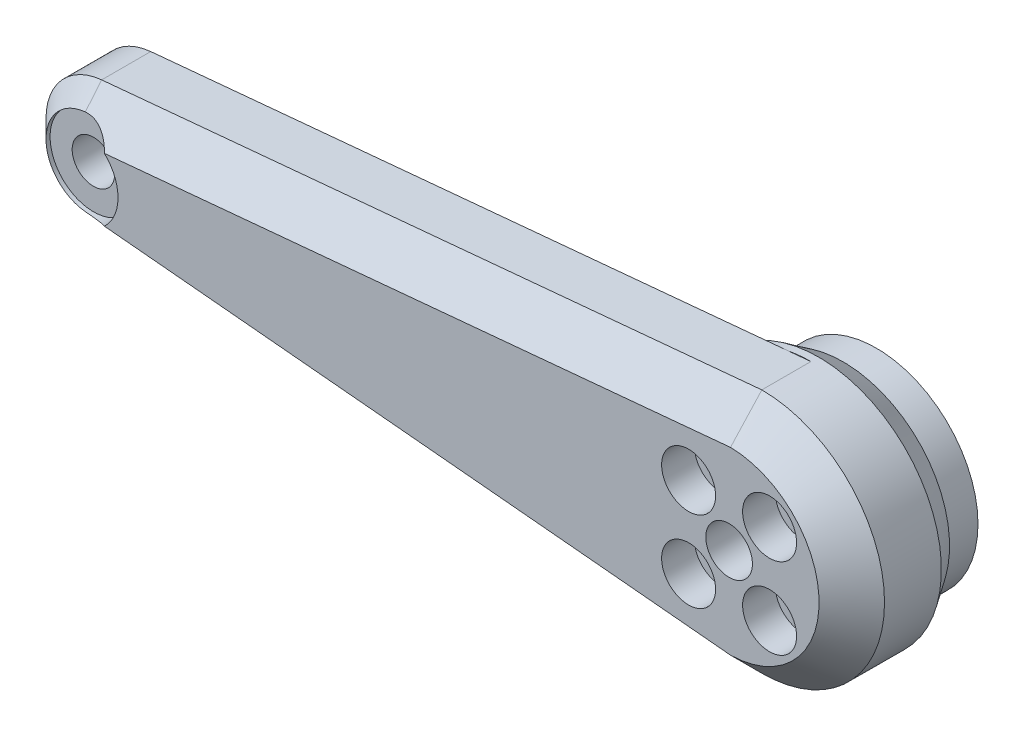
ISO-10303-21;
HEADER;
FILE_DESCRIPTION(('STEP AP214'),'2;1');
FILE_NAME('part.step','',(''),(''),'','','');
FILE_SCHEMA(('AUTOMOTIVE_DESIGN { 1 0 10303 214 1 1 1 1 }'));
ENDSEC;
DATA;
#1=APPLICATION_CONTEXT('core data for automotive mechanical design processes');
#2=APPLICATION_PROTOCOL_DEFINITION('international standard','automotive_design',2000,#1);
#3=PRODUCT_CONTEXT('',#1,'mechanical');
#4=PRODUCT('Part','Part','',(#3));
#5=PRODUCT_RELATED_PRODUCT_CATEGORY('part','',(#4));
#6=PRODUCT_DEFINITION_FORMATION('','',#4);
#7=PRODUCT_DEFINITION_CONTEXT('part definition',#1,'design');
#8=PRODUCT_DEFINITION('design','',#6,#7);
#9=PRODUCT_DEFINITION_SHAPE('','',#8);
#10=(LENGTH_UNIT() NAMED_UNIT(*) SI_UNIT(.MILLI.,.METRE.));
#11=(NAMED_UNIT(*) PLANE_ANGLE_UNIT() SI_UNIT($,.RADIAN.));
#12=(NAMED_UNIT(*) SI_UNIT($,.STERADIAN.) SOLID_ANGLE_UNIT());
#13=UNCERTAINTY_MEASURE_WITH_UNIT(LENGTH_MEASURE(1.E-05),#10,'distance_accuracy_value','');
#14=(GEOMETRIC_REPRESENTATION_CONTEXT(3) GLOBAL_UNCERTAINTY_ASSIGNED_CONTEXT((#13)) GLOBAL_UNIT_ASSIGNED_CONTEXT((#10,
#11,#12)) REPRESENTATION_CONTEXT('',''));
#15=CARTESIAN_POINT('',(0.,0.,0.));
#16=DIRECTION('',(0.,0.,1.));
#17=DIRECTION('',(1.,0.,0.));
#18=AXIS2_PLACEMENT_3D('',#15,#16,#17);
#19=CARTESIAN_POINT('',(-4.94974746830583,4.94974746830583,10.));
#20=DIRECTION('',(0.,0.,-1.));
#21=DIRECTION('',(-1.,0.,0.));
#22=AXIS2_PLACEMENT_3D('',#19,#20,#21);
#23=CYLINDRICAL_SURFACE('',#22,1.75);
#24=CARTESIAN_POINT('',(-4.94974746830583,4.94974746830583,-8.));
#25=DIRECTION('',(0.,0.,-1.));
#26=DIRECTION('',(-1.,0.,0.));
#27=AXIS2_PLACEMENT_3D('',#24,#25,#26);
#28=CIRCLE('',#27,1.75);
#29=CARTESIAN_POINT('',(-6.69974746830583,4.94974746830583,-8.));
#30=VERTEX_POINT('',#29);
#31=EDGE_CURVE('E371',#30,#30,#28,.T.);
#32=ORIENTED_EDGE('',*,*,#31,.T.);
#33=EDGE_LOOP('',(#32));
#34=FACE_BOUND('',#33,.T.);
#35=CARTESIAN_POINT('',(-4.94974746830583,4.94974746830583,6.));
#36=DIRECTION('',(0.,0.,1.));
#37=DIRECTION('',(1.,0.,0.));
#38=AXIS2_PLACEMENT_3D('',#35,#36,#37);
#39=CIRCLE('',#38,1.75);
#40=CARTESIAN_POINT('',(-3.19974746830583,4.94974746830583,6.));
#41=VERTEX_POINT('',#40);
#42=EDGE_CURVE('E48',#41,#41,#39,.F.);
#43=ORIENTED_EDGE('',*,*,#42,.F.);
#44=EDGE_LOOP('',(#43));
#45=FACE_BOUND('',#44,.T.);
#46=ADVANCED_FACE('F43',(#34,#45),#23,.F.);
#47=CARTESIAN_POINT('',(4.94974746830581,4.94974746830584,10.));
#48=DIRECTION('',(0.,0.,-1.));
#49=DIRECTION('',(-1.,0.,0.));
#50=AXIS2_PLACEMENT_3D('',#47,#48,#49);
#51=CYLINDRICAL_SURFACE('',#50,1.75);
#52=CARTESIAN_POINT('',(4.94974746830581,4.94974746830584,-8.));
#53=DIRECTION('',(0.,0.,-1.));
#54=DIRECTION('',(-1.,0.,0.));
#55=AXIS2_PLACEMENT_3D('',#52,#53,#54);
#56=CIRCLE('',#55,1.75);
#57=CARTESIAN_POINT('',(3.19974746830581,4.94974746830584,-8.));
#58=VERTEX_POINT('',#57);
#59=EDGE_CURVE('E367',#58,#58,#56,.T.);
#60=ORIENTED_EDGE('',*,*,#59,.T.);
#61=EDGE_LOOP('',(#60));
#62=FACE_BOUND('',#61,.T.);
#63=CARTESIAN_POINT('',(4.94974746830581,4.94974746830584,6.));
#64=DIRECTION('',(0.,0.,1.));
#65=DIRECTION('',(1.,0.,0.));
#66=AXIS2_PLACEMENT_3D('',#63,#64,#65);
#67=CIRCLE('',#66,1.75);
#68=CARTESIAN_POINT('',(6.69974746830581,4.94974746830584,6.));
#69=VERTEX_POINT('',#68);
#70=EDGE_CURVE('E231',#69,#69,#67,.F.);
#71=ORIENTED_EDGE('',*,*,#70,.F.);
#72=EDGE_LOOP('',(#71));
#73=FACE_BOUND('',#72,.T.);
#74=ADVANCED_FACE('F243',(#62,#73),#51,.F.);
#75=CARTESIAN_POINT('',(4.94974746830583,-4.94974746830584,10.));
#76=DIRECTION('',(0.,0.,-1.));
#77=DIRECTION('',(-1.,0.,0.));
#78=AXIS2_PLACEMENT_3D('',#75,#76,#77);
#79=CYLINDRICAL_SURFACE('',#78,1.75);
#80=CARTESIAN_POINT('',(4.94974746830583,-4.94974746830584,-8.));
#81=DIRECTION('',(0.,0.,-1.));
#82=DIRECTION('',(-1.,0.,0.));
#83=AXIS2_PLACEMENT_3D('',#80,#81,#82);
#84=CIRCLE('',#83,1.75);
#85=CARTESIAN_POINT('',(3.19974746830583,-4.94974746830584,-8.));
#86=VERTEX_POINT('',#85);
#87=EDGE_CURVE('E372',#86,#86,#84,.T.);
#88=ORIENTED_EDGE('',*,*,#87,.T.);
#89=EDGE_LOOP('',(#88));
#90=FACE_BOUND('',#89,.T.);
#91=CARTESIAN_POINT('',(4.94974746830583,-4.94974746830584,6.));
#92=DIRECTION('',(0.,0.,1.));
#93=DIRECTION('',(1.,0.,0.));
#94=AXIS2_PLACEMENT_3D('',#91,#92,#93);
#95=CIRCLE('',#94,1.75);
#96=CARTESIAN_POINT('',(6.69974746830583,-4.94974746830584,6.));
#97=VERTEX_POINT('',#96);
#98=EDGE_CURVE('E227',#97,#97,#95,.F.);
#99=ORIENTED_EDGE('',*,*,#98,.F.);
#100=EDGE_LOOP('',(#99));
#101=FACE_BOUND('',#100,.T.);
#102=ADVANCED_FACE('F249',(#90,#101),#79,.F.);
#103=CARTESIAN_POINT('',(-4.94974746830582,-4.94974746830585,10.));
#104=DIRECTION('',(0.,0.,-1.));
#105=DIRECTION('',(-1.,0.,0.));
#106=AXIS2_PLACEMENT_3D('',#103,#104,#105);
#107=CYLINDRICAL_SURFACE('',#106,1.75);
#108=CARTESIAN_POINT('',(-4.94974746830582,-4.94974746830585,-8.));
#109=DIRECTION('',(0.,0.,-1.));
#110=DIRECTION('',(-1.,0.,0.));
#111=AXIS2_PLACEMENT_3D('',#108,#109,#110);
#112=CIRCLE('',#111,1.75);
#113=CARTESIAN_POINT('',(-6.69974746830582,-4.94974746830585,-8.));
#114=VERTEX_POINT('',#113);
#115=EDGE_CURVE('E363',#114,#114,#112,.T.);
#116=ORIENTED_EDGE('',*,*,#115,.T.);
#117=EDGE_LOOP('',(#116));
#118=FACE_BOUND('',#117,.T.);
#119=CARTESIAN_POINT('',(-4.94974746830582,-4.94974746830585,6.));
#120=DIRECTION('',(0.,0.,1.));
#121=DIRECTION('',(1.,0.,0.));
#122=AXIS2_PLACEMENT_3D('',#119,#120,#121);
#123=CIRCLE('',#122,1.75);
#124=CARTESIAN_POINT('',(-3.19974746830582,-4.94974746830585,6.));
#125=VERTEX_POINT('',#124);
#126=EDGE_CURVE('E223',#125,#125,#123,.F.);
#127=ORIENTED_EDGE('',*,*,#126,.F.);
#128=EDGE_LOOP('',(#127));
#129=FACE_BOUND('',#128,.T.);
#130=ADVANCED_FACE('F255',(#118,#129),#107,.F.);
#131=CARTESIAN_POINT('',(-80.,0.,-8.));
#132=DIRECTION('',(0.,0.,1.));
#133=DIRECTION('',(1.,0.,0.));
#134=AXIS2_PLACEMENT_3D('',#131,#132,#133);
#135=CYLINDRICAL_SURFACE('',#134,2.6);
#136=CARTESIAN_POINT('',(-80.,0.,2.3));
#137=DIRECTION('',(0.,0.,-1.));
#138=DIRECTION('',(-1.,0.,0.));
#139=AXIS2_PLACEMENT_3D('',#136,#137,#138);
#140=CIRCLE('',#139,2.6);
#141=CARTESIAN_POINT('',(-82.6,0.,2.3));
#142=VERTEX_POINT('',#141);
#143=EDGE_CURVE('E208',#142,#142,#140,.F.);
#144=ORIENTED_EDGE('',*,*,#143,.F.);
#145=EDGE_LOOP('',(#144));
#146=FACE_BOUND('',#145,.T.);
#147=CARTESIAN_POINT('',(-80.,0.,7.7));
#148=DIRECTION('',(0.,0.,1.));
#149=DIRECTION('',(1.,0.,0.));
#150=AXIS2_PLACEMENT_3D('',#147,#148,#149);
#151=CIRCLE('',#150,2.6);
#152=CARTESIAN_POINT('',(-77.4,0.,7.7));
#153=VERTEX_POINT('',#152);
#154=EDGE_CURVE('E133',#153,#153,#151,.F.);
#155=ORIENTED_EDGE('',*,*,#154,.F.);
#156=EDGE_LOOP('',(#155));
#157=FACE_BOUND('',#156,.T.);
#158=ADVANCED_FACE('F273',(#146,#157),#135,.F.);
#159=CARTESIAN_POINT('',(0.,0.,0.));
#160=DIRECTION('',(0.,0.,1.));
#161=DIRECTION('',(1.,0.,0.));
#162=AXIS2_PLACEMENT_3D('',#159,#160,#161);
#163=PLANE('',#162);
#164=CARTESIAN_POINT('',(-80.,0.,0.));
#165=DIRECTION('',(0.,0.,-1.));
#166=DIRECTION('',(-1.,0.,0.));
#167=AXIS2_PLACEMENT_3D('',#164,#165,#166);
#168=CIRCLE('',#167,5.20000000000001);
#169=CARTESIAN_POINT('',(-85.2,0.,0.));
#170=VERTEX_POINT('',#169);
#171=EDGE_CURVE('E219',#170,#170,#168,.T.);
#172=ORIENTED_EDGE('',*,*,#171,.F.);
#173=EDGE_LOOP('',(#172));
#174=FACE_BOUND('',#173,.T.);
#175=CARTESIAN_POINT('',(0.,0.,0.));
#176=DIRECTION('',(0.,0.,-1.));
#177=DIRECTION('',(-1.,0.,0.));
#178=AXIS2_PLACEMENT_3D('',#175,#176,#177);
#179=CIRCLE('',#178,15.);
#180=CARTESIAN_POINT('',(-2.77608663815124,-14.7408732094635,0.));
#181=VERTEX_POINT('',#180);
#182=CARTESIAN_POINT('',(-2.77608663815124,14.7408732094635,0.));
#183=VERTEX_POINT('',#182);
#184=EDGE_CURVE('E302',#181,#183,#179,.T.);
#185=ORIENTED_EDGE('',*,*,#184,.F.);
#186=DIRECTION('',(0.995671853732669,-0.0929384725748753,0.));
#187=VECTOR('',#186,1.);
#188=CARTESIAN_POINT('',(-1.38804331907563,-14.8704366047317,0.));
#189=LINE('',#188,#187);
#190=CARTESIAN_POINT('',(-80.6970385443116,-7.46753890299503,0.));
#191=VERTEX_POINT('',#190);
#192=EDGE_CURVE('E296',#191,#181,#189,.T.);
#193=ORIENTED_EDGE('',*,*,#192,.F.);
#194=CARTESIAN_POINT('',(-80.,0.,0.));
#195=DIRECTION('',(0.,0.,1.));
#196=DIRECTION('',(1.,0.,0.));
#197=AXIS2_PLACEMENT_3D('',#194,#195,#196);
#198=CIRCLE('',#197,7.5);
#199=CARTESIAN_POINT('',(-80.6970385443116,7.46753890299501,0.));
#200=VERTEX_POINT('',#199);
#201=EDGE_CURVE('E207',#200,#191,#198,.T.);
#202=ORIENTED_EDGE('',*,*,#201,.F.);
#203=DIRECTION('',(0.995671853732669,0.0929384725748753,0.));
#204=VECTOR('',#203,1.);
#205=CARTESIAN_POINT('',(-1.38804331907563,14.8704366047317,0.));
#206=LINE('',#205,#204);
#207=EDGE_CURVE('E304',#200,#183,#206,.T.);
#208=ORIENTED_EDGE('',*,*,#207,.T.);
#209=EDGE_LOOP('',(#185,#193,#202,#208));
#210=FACE_BOUND('',#209,.T.);
#211=ADVANCED_FACE('F269',(#174,#210),#163,.F.);
#212=CARTESIAN_POINT('',(-80.,0.,10.));
#213=DIRECTION('',(0.,0.,-1.));
#214=DIRECTION('',(-1.,0.,0.));
#215=AXIS2_PLACEMENT_3D('',#212,#213,#214);
#216=CYLINDRICAL_SURFACE('',#215,7.5);
#217=DIRECTION('',(0.,0.,-1.));
#218=VECTOR('',#217,1.);
#219=CARTESIAN_POINT('',(-80.6970385443116,-7.46753890299503,10.));
#220=LINE('',#219,#218);
#221=CARTESIAN_POINT('',(-80.6970385443116,-7.46753890299503,6.));
#222=VERTEX_POINT('',#221);
#223=EDGE_CURVE('E140',#222,#191,#220,.T.);
#224=ORIENTED_EDGE('',*,*,#223,.F.);
#225=CARTESIAN_POINT('',(-80.,0.,6.));
#226=DIRECTION('',(0.,0.,1.));
#227=DIRECTION('',(1.,0.,0.));
#228=AXIS2_PLACEMENT_3D('',#225,#226,#227);
#229=CIRCLE('',#228,7.5);
#230=CARTESIAN_POINT('',(-80.6970385443116,7.46753890299501,6.));
#231=VERTEX_POINT('',#230);
#232=EDGE_CURVE('E156',#222,#231,#229,.F.);
#233=ORIENTED_EDGE('',*,*,#232,.T.);
#234=DIRECTION('',(0.,0.,-1.));
#235=VECTOR('',#234,1.);
#236=CARTESIAN_POINT('',(-80.6970385443116,7.46753890299501,10.));
#237=LINE('',#236,#235);
#238=EDGE_CURVE('E308',#231,#200,#237,.T.);
#239=ORIENTED_EDGE('',*,*,#238,.T.);
#240=ORIENTED_EDGE('',*,*,#201,.T.);
#241=EDGE_LOOP('',(#224,#233,#239,#240));
#242=FACE_BOUND('',#241,.T.);
#243=ADVANCED_FACE('F272',(#242),#216,.T.);
#244=CARTESIAN_POINT('',(-1.38804331907563,-14.8704366047317,10.));
#245=DIRECTION('',(0.0929384725748753,0.995671853732669,0.));
#246=DIRECTION('',(-0.995671853732669,0.0929384725748753,0.));
#247=AXIS2_PLACEMENT_3D('',#244,#245,#246);
#248=PLANE('',#247);
#249=DIRECTION('',(0.,0.,-1.));
#250=VECTOR('',#249,1.);
#251=CARTESIAN_POINT('',(0.,-15.,10.));
#252=LINE('',#251,#250);
#253=CARTESIAN_POINT('',(0.,-15.,6.));
#254=VERTEX_POINT('',#253);
#255=CARTESIAN_POINT('',(0.,-15.,0.));
#256=VERTEX_POINT('',#255);
#257=EDGE_CURVE('E146',#254,#256,#252,.T.);
#258=ORIENTED_EDGE('',*,*,#257,.F.);
#259=DIRECTION('',(-0.995671853732669,0.0929384725748753,0.));
#260=VECTOR('',#259,1.);
#261=CARTESIAN_POINT('',(-80.6970385443116,-7.46753890299503,6.));
#262=LINE('',#261,#260);
#263=EDGE_CURVE('E152',#254,#222,#262,.T.);
#264=ORIENTED_EDGE('',*,*,#263,.T.);
#265=ORIENTED_EDGE('',*,*,#223,.T.);
#266=ORIENTED_EDGE('',*,*,#192,.T.);
#267=DIRECTION('',(-0.995671853732669,0.0929384725748753,0.));
#268=VECTOR('',#267,1.);
#269=CARTESIAN_POINT('',(-1.38804331907563,-14.8704366047317,0.));
#270=LINE('',#269,#268);
#271=EDGE_CURVE('E323',#256,#181,#270,.T.);
#272=ORIENTED_EDGE('',*,*,#271,.F.);
#273=EDGE_LOOP('',(#258,#264,#265,#266,#272));
#274=FACE_BOUND('',#273,.T.);
#275=ADVANCED_FACE('F280',(#274),#248,.F.);
#276=CARTESIAN_POINT('',(0.,0.,10.));
#277=DIRECTION('',(0.,0.,-1.));
#278=DIRECTION('',(-1.,0.,0.));
#279=AXIS2_PLACEMENT_3D('',#276,#277,#278);
#280=CYLINDRICAL_SURFACE('',#279,15.);
#281=CARTESIAN_POINT('',(0.,0.,-0.949999999999967));
#282=DIRECTION('',(0.,0.,-1.));
#283=DIRECTION('',(-1.,0.,0.));
#284=AXIS2_PLACEMENT_3D('',#281,#282,#283);
#285=CIRCLE('',#284,15.);
#286=CARTESIAN_POINT('',(-15.,0.,-0.949999999999967));
#287=VERTEX_POINT('',#286);
#288=EDGE_CURVE('E11',#287,#287,#285,.F.);
#289=ORIENTED_EDGE('',*,*,#288,.T.);
#290=EDGE_LOOP('',(#289));
#291=FACE_BOUND('',#290,.T.);
#292=DIRECTION('',(0.,0.,-1.));
#293=VECTOR('',#292,1.);
#294=CARTESIAN_POINT('',(0.,15.,10.));
#295=LINE('',#294,#293);
#296=CARTESIAN_POINT('',(0.,15.,6.));
#297=VERTEX_POINT('',#296);
#298=CARTESIAN_POINT('',(0.,15.,0.));
#299=VERTEX_POINT('',#298);
#300=EDGE_CURVE('E315',#297,#299,#295,.T.);
#301=ORIENTED_EDGE('',*,*,#300,.F.);
#302=CARTESIAN_POINT('',(0.,0.,6.));
#303=DIRECTION('',(0.,0.,1.));
#304=DIRECTION('',(1.,0.,0.));
#305=AXIS2_PLACEMENT_3D('',#302,#303,#304);
#306=CIRCLE('',#305,15.);
#307=EDGE_CURVE('E160',#297,#254,#306,.F.);
#308=ORIENTED_EDGE('',*,*,#307,.T.);
#309=ORIENTED_EDGE('',*,*,#257,.T.);
#310=EDGE_CURVE('E321',#256,#181,#179,.T.);
#311=ORIENTED_EDGE('',*,*,#310,.T.);
#312=ORIENTED_EDGE('',*,*,#184,.T.);
#313=EDGE_CURVE('E349',#183,#299,#179,.T.);
#314=ORIENTED_EDGE('',*,*,#313,.T.);
#315=EDGE_LOOP('',(#301,#308,#309,#311,#312,#314));
#316=FACE_BOUND('',#315,.T.);
#317=ADVANCED_FACE('F277',(#291,#316),#280,.T.);
#318=CARTESIAN_POINT('',(-1.38804331907563,14.8704366047317,10.));
#319=DIRECTION('',(-0.0929384725748753,0.995671853732669,0.));
#320=DIRECTION('',(-0.995671853732669,-0.0929384725748753,0.));
#321=AXIS2_PLACEMENT_3D('',#318,#319,#320);
#322=PLANE('',#321);
#323=ORIENTED_EDGE('',*,*,#238,.F.);
#324=DIRECTION('',(0.995671853732669,0.0929384725748753,0.));
#325=VECTOR('',#324,1.);
#326=CARTESIAN_POINT('',(-1.38804331907563,14.8704366047317,6.));
#327=LINE('',#326,#325);
#328=EDGE_CURVE('E70',#231,#297,#327,.T.);
#329=ORIENTED_EDGE('',*,*,#328,.T.);
#330=ORIENTED_EDGE('',*,*,#300,.T.);
#331=DIRECTION('',(-0.995671853732669,-0.0929384725748753,0.));
#332=VECTOR('',#331,1.);
#333=CARTESIAN_POINT('',(-1.38804331907563,14.8704366047317,0.));
#334=LINE('',#333,#332);
#335=EDGE_CURVE('E352',#299,#183,#334,.T.);
#336=ORIENTED_EDGE('',*,*,#335,.T.);
#337=ORIENTED_EDGE('',*,*,#207,.F.);
#338=EDGE_LOOP('',(#323,#329,#330,#336,#337));
#339=FACE_BOUND('',#338,.T.);
#340=ADVANCED_FACE('F267',(#339),#322,.T.);
#341=CARTESIAN_POINT('',(0.,0.,10.));
#342=DIRECTION('',(0.,0.,1.));
#343=DIRECTION('',(1.,0.,0.));
#344=AXIS2_PLACEMENT_3D('',#341,#342,#343);
#345=PLANE('',#344);
#346=CARTESIAN_POINT('',(-4.94974746830583,4.94974746830583,10.));
#347=DIRECTION('',(0.,0.,1.));
#348=DIRECTION('',(1.,0.,0.));
#349=AXIS2_PLACEMENT_3D('',#346,#347,#348);
#350=CIRCLE('',#349,3.3);
#351=CARTESIAN_POINT('',(-1.64974746830583,4.94974746830583,10.));
#352=VERTEX_POINT('',#351);
#353=EDGE_CURVE('E718',#352,#352,#350,.T.);
#354=ORIENTED_EDGE('',*,*,#353,.F.);
#355=EDGE_LOOP('',(#354));
#356=FACE_BOUND('',#355,.T.);
#357=CARTESIAN_POINT('',(-4.94974746830582,-4.94974746830585,10.));
#358=DIRECTION('',(0.,0.,1.));
#359=DIRECTION('',(1.,0.,0.));
#360=AXIS2_PLACEMENT_3D('',#357,#358,#359);
#361=CIRCLE('',#360,3.3);
#362=CARTESIAN_POINT('',(-1.64974746830582,-4.94974746830585,10.));
#363=VERTEX_POINT('',#362);
#364=EDGE_CURVE('E726',#363,#363,#361,.T.);
#365=ORIENTED_EDGE('',*,*,#364,.F.);
#366=EDGE_LOOP('',(#365));
#367=FACE_BOUND('',#366,.T.);
#368=CARTESIAN_POINT('',(4.94974746830583,-4.94974746830584,10.));
#369=DIRECTION('',(0.,0.,1.));
#370=DIRECTION('',(1.,0.,0.));
#371=AXIS2_PLACEMENT_3D('',#368,#369,#370);
#372=CIRCLE('',#371,3.3);
#373=CARTESIAN_POINT('',(8.24974746830583,-4.94974746830584,10.));
#374=VERTEX_POINT('',#373);
#375=EDGE_CURVE('E715',#374,#374,#372,.T.);
#376=ORIENTED_EDGE('',*,*,#375,.F.);
#377=EDGE_LOOP('',(#376));
#378=FACE_BOUND('',#377,.T.);
#379=CARTESIAN_POINT('',(4.94974746830581,4.94974746830584,10.));
#380=DIRECTION('',(0.,0.,1.));
#381=DIRECTION('',(1.,0.,0.));
#382=AXIS2_PLACEMENT_3D('',#379,#380,#381);
#383=CIRCLE('',#382,3.3);
#384=CARTESIAN_POINT('',(8.24974746830581,4.94974746830584,10.));
#385=VERTEX_POINT('',#384);
#386=EDGE_CURVE('E707',#385,#385,#383,.T.);
#387=ORIENTED_EDGE('',*,*,#386,.F.);
#388=EDGE_LOOP('',(#387));
#389=FACE_BOUND('',#388,.T.);
#390=CARTESIAN_POINT('',(-80.,0.,10.));
#391=DIRECTION('',(0.,0.,1.));
#392=DIRECTION('',(1.,0.,0.));
#393=AXIS2_PLACEMENT_3D('',#390,#391,#392);
#394=CIRCLE('',#393,5.3);
#395=CARTESIAN_POINT('',(-76.3625607102334,-3.85474193860784,10.));
#396=VERTEX_POINT('',#395);
#397=CARTESIAN_POINT('',(-76.3625607102334,3.85474193860784,10.));
#398=VERTEX_POINT('',#397);
#399=EDGE_CURVE('E112',#396,#398,#394,.T.);
#400=ORIENTED_EDGE('',*,*,#399,.F.);
#401=DIRECTION('',(0.995671853732669,-0.0929384725748753,0.));
#402=VECTOR('',#401,1.);
#403=CARTESIAN_POINT('',(0.371753890299503,-11.0173125850693,10.));
#404=LINE('',#403,#402);
#405=CARTESIAN_POINT('',(0.171891053371102,-10.9986568937198,10.));
#406=VERTEX_POINT('',#405);
#407=EDGE_CURVE('E144',#396,#406,#404,.T.);
#408=ORIENTED_EDGE('',*,*,#407,.T.);
#409=CARTESIAN_POINT('',(0.,0.,10.));
#410=DIRECTION('',(0.,0.,1.));
#411=DIRECTION('',(1.,0.,0.));
#412=AXIS2_PLACEMENT_3D('',#409,#410,#411);
#413=CIRCLE('',#412,11.);
#414=CARTESIAN_POINT('',(0.17189105337112,10.9986568937198,10.));
#415=VERTEX_POINT('',#414);
#416=EDGE_CURVE('E138',#406,#415,#413,.T.);
#417=ORIENTED_EDGE('',*,*,#416,.T.);
#418=DIRECTION('',(-0.995671853732669,-0.0929384725748753,0.));
#419=VECTOR('',#418,1.);
#420=CARTESIAN_POINT('',(-1.01628942877613,10.887749189801,10.));
#421=LINE('',#420,#419);
#422=EDGE_CURVE('E129',#415,#398,#421,.T.);
#423=ORIENTED_EDGE('',*,*,#422,.T.);
#424=EDGE_LOOP('',(#400,#408,#417,#423));
#425=FACE_BOUND('',#424,.T.);
#426=CARTESIAN_POINT('',(0.,0.,10.));
#427=DIRECTION('',(0.,0.,1.));
#428=DIRECTION('',(1.,0.,0.));
#429=AXIS2_PLACEMENT_3D('',#426,#427,#428);
#430=CIRCLE('',#429,2.85);
#431=CARTESIAN_POINT('',(2.85,0.,10.));
#432=VERTEX_POINT('',#431);
#433=EDGE_CURVE('E358',#432,#432,#430,.T.);
#434=ORIENTED_EDGE('',*,*,#433,.F.);
#435=EDGE_LOOP('',(#434));
#436=FACE_BOUND('',#435,.T.);
#437=ADVANCED_FACE('F135',(#356,#367,#378,#389,#425,#436),#345,.T.);
#438=CARTESIAN_POINT('',(-1.38804331907563,14.8704366047317,6.));
#439=DIRECTION('',(0.0657174241908141,-0.704046319610949,-0.707106781186549));
#440=DIRECTION('',(0.995671853732669,0.0929384725748753,0.));
#441=AXIS2_PLACEMENT_3D('',#438,#439,#440);
#442=PLANE('',#441);
#443=CARTESIAN_POINT('',(-80.,0.,13.5));
#444=DIRECTION('',(0.0657174241908141,-0.704046319610949,-0.707106781186549));
#445=DIRECTION('',(0.0657174241908145,-0.704046319610952,0.707106781186546));
#446=AXIS2_PLACEMENT_3D('',#443,#444,#445);
#447=ELLIPSE('',#446,7.49533188057738,5.3);
#448=CARTESIAN_POINT('',(-80.4925739046468,5.27706082478316,8.19999999999998));
#449=VERTEX_POINT('',#448);
#450=EDGE_CURVE('E116',#398,#449,#447,.F.);
#451=ORIENTED_EDGE('',*,*,#450,.F.);
#452=ORIENTED_EDGE('',*,*,#422,.F.);
#453=CARTESIAN_POINT('',(0.17189105337112,10.9986568937198,10.));
#454=CARTESIAN_POINT('',(0.145825679362528,11.6657234953894,9.333398084105));
#455=CARTESIAN_POINT('',(0.11846873337374,12.3327021519319,8.66676369597072));
#456=CARTESIAN_POINT('',(0.0611717140823926,13.6664831872564,7.33343036259965));
#457=CARTESIAN_POINT('',(0.0312316422808046,14.3332855661407,6.6667314174006));
#458=CARTESIAN_POINT('',(0.,15.,6.));
#459=B_SPLINE_CURVE_WITH_KNOTS('',3,(#453,#454,#455,#456,#457,#458),.UNSPECIFIED.,.F.,.F.,(4,2,
4),(0.,2.83021077730651,5.66041991007963),.UNSPECIFIED.);
#460=EDGE_CURVE('E198',#297,#415,#459,.F.);
#461=ORIENTED_EDGE('',*,*,#460,.F.);
#462=ORIENTED_EDGE('',*,*,#328,.F.);
#463=DIRECTION('',(-0.0657174241908144,0.704046319610952,-0.707106781186546));
#464=VECTOR('',#463,1.);
#465=CARTESIAN_POINT('',(-80.3252846540121,3.48485148806432,10.));
#466=LINE('',#465,#464);
#467=EDGE_CURVE('E131',#449,#231,#466,.T.);
#468=ORIENTED_EDGE('',*,*,#467,.F.);
#469=EDGE_LOOP('',(#451,#452,#461,#462,#468));
#470=FACE_BOUND('',#469,.T.);
#471=ADVANCED_FACE('F127',(#470),#442,.F.);
#472=CARTESIAN_POINT('',(-80.,0.,10.));
#473=DIRECTION('',(0.,0.,-1.));
#474=DIRECTION('',(-1.,0.,0.));
#475=AXIS2_PLACEMENT_3D('',#472,#473,#474);
#476=CONICAL_SURFACE('',#475,3.49999999999997,0.785398163397451);
#477=CARTESIAN_POINT('',(-80.,0.,8.19999999999998));
#478=DIRECTION('',(0.,0.,-1.));
#479=DIRECTION('',(-1.,0.,0.));
#480=AXIS2_PLACEMENT_3D('',#477,#478,#479);
#481=CIRCLE('',#480,5.3);
#482=CARTESIAN_POINT('',(-80.4925739046468,-5.27706082478316,8.19999999999998));
#483=VERTEX_POINT('',#482);
#484=EDGE_CURVE('E62',#449,#483,#481,.F.);
#485=ORIENTED_EDGE('',*,*,#484,.F.);
#486=ORIENTED_EDGE('',*,*,#467,.T.);
#487=ORIENTED_EDGE('',*,*,#232,.F.);
#488=DIRECTION('',(-0.0657174241908144,-0.704046319610952,-0.707106781186546));
#489=VECTOR('',#488,1.);
#490=CARTESIAN_POINT('',(-80.3252846540121,-3.48485148806433,10.));
#491=LINE('',#490,#489);
#492=EDGE_CURVE('E175',#483,#222,#491,.T.);
#493=ORIENTED_EDGE('',*,*,#492,.F.);
#494=EDGE_LOOP('',(#485,#486,#487,#493));
#495=FACE_BOUND('',#494,.T.);
#496=ADVANCED_FACE('F197',(#495),#476,.T.);
#497=CARTESIAN_POINT('',(0.,0.,10.));
#498=DIRECTION('',(0.,0.,-1.));
#499=DIRECTION('',(-1.,0.,0.));
#500=AXIS2_PLACEMENT_3D('',#497,#498,#499);
#501=CONICAL_SURFACE('',#500,11.,0.785398163397451);
#502=ORIENTED_EDGE('',*,*,#460,.T.);
#503=ORIENTED_EDGE('',*,*,#416,.F.);
#504=CARTESIAN_POINT('',(0.171891053371102,-10.9986568937198,10.));
#505=CARTESIAN_POINT('',(0.145825679362519,-11.6657234953894,9.333398084105));
#506=CARTESIAN_POINT('',(0.118468733373737,-12.3327021519319,8.66676369597072));
#507=CARTESIAN_POINT('',(0.0611717140823958,-13.6664831872564,7.33343036259965));
#508=CARTESIAN_POINT('',(0.031231642280808,-14.3332855661407,6.6667314174006));
#509=CARTESIAN_POINT('',(0.,-15.,6.));
#510=B_SPLINE_CURVE_WITH_KNOTS('',3,(#504,#505,#506,#507,#508,#509),.UNSPECIFIED.,.F.,.F.,(4,2,
4),(0.,2.83021077730651,5.66041991007963),.UNSPECIFIED.);
#511=EDGE_CURVE('E165',#254,#406,#510,.F.);
#512=ORIENTED_EDGE('',*,*,#511,.F.);
#513=ORIENTED_EDGE('',*,*,#307,.F.);
#514=EDGE_LOOP('',(#502,#503,#512,#513));
#515=FACE_BOUND('',#514,.T.);
#516=ADVANCED_FACE('F179',(#515),#501,.T.);
#517=CARTESIAN_POINT('',(-1.01628942877613,-10.887749189801,10.));
#518=DIRECTION('',(-0.0657174241908141,-0.704046319610949,0.707106781186549));
#519=DIRECTION('',(-0.995671853732669,0.0929384725748753,0.));
#520=AXIS2_PLACEMENT_3D('',#517,#518,#519);
#521=PLANE('',#520);
#522=CARTESIAN_POINT('',(-80.,0.,13.5));
#523=DIRECTION('',(-0.0657174241908141,-0.704046319610949,0.707106781186549));
#524=DIRECTION('',(0.0657174241908145,0.704046319610952,0.707106781186546));
#525=AXIS2_PLACEMENT_3D('',#522,#523,#524);
#526=ELLIPSE('',#525,7.49533188057738,5.3);
#527=EDGE_CURVE('E117',#483,#396,#526,.T.);
#528=ORIENTED_EDGE('',*,*,#527,.F.);
#529=ORIENTED_EDGE('',*,*,#492,.T.);
#530=ORIENTED_EDGE('',*,*,#263,.F.);
#531=ORIENTED_EDGE('',*,*,#511,.T.);
#532=ORIENTED_EDGE('',*,*,#407,.F.);
#533=EDGE_LOOP('',(#528,#529,#530,#531,#532));
#534=FACE_BOUND('',#533,.T.);
#535=ADVANCED_FACE('F183',(#534),#521,.T.);
#536=CARTESIAN_POINT('',(0.,0.,-8.));
#537=DIRECTION('',(0.,0.,1.));
#538=DIRECTION('',(1.,0.,0.));
#539=AXIS2_PLACEMENT_3D('',#536,#537,#538);
#540=CYLINDRICAL_SURFACE('',#539,12.425);
#541=CARTESIAN_POINT('',(0.,0.,-3.95));
#542=DIRECTION('',(0.,0.,-1.));
#543=DIRECTION('',(-1.,0.,0.));
#544=AXIS2_PLACEMENT_3D('',#541,#542,#543);
#545=CIRCLE('',#544,12.425);
#546=CARTESIAN_POINT('',(-12.425,0.,-3.95));
#547=VERTEX_POINT('',#546);
#548=EDGE_CURVE('E212',#547,#547,#545,.T.);
#549=ORIENTED_EDGE('',*,*,#548,.T.);
#550=EDGE_LOOP('',(#549));
#551=FACE_BOUND('',#550,.T.);
#552=CARTESIAN_POINT('',(0.,0.,-8.));
#553=DIRECTION('',(0.,0.,-1.));
#554=DIRECTION('',(-1.,0.,0.));
#555=AXIS2_PLACEMENT_3D('',#552,#553,#554);
#556=CIRCLE('',#555,12.425);
#557=CARTESIAN_POINT('',(-12.425,0.,-8.));
#558=VERTEX_POINT('',#557);
#559=EDGE_CURVE('E176',#558,#558,#556,.T.);
#560=ORIENTED_EDGE('',*,*,#559,.F.);
#561=EDGE_LOOP('',(#560));
#562=FACE_BOUND('',#561,.T.);
#563=ADVANCED_FACE('F190',(#551,#562),#540,.T.);
#564=CARTESIAN_POINT('',(0.,0.,-8.));
#565=DIRECTION('',(0.,0.,-1.));
#566=DIRECTION('',(-1.,0.,0.));
#567=AXIS2_PLACEMENT_3D('',#564,#565,#566);
#568=PLANE('',#567);
#569=CARTESIAN_POINT('',(0.,0.,-8.));
#570=DIRECTION('',(0.,0.,1.));
#571=DIRECTION('',(1.,0.,0.));
#572=AXIS2_PLACEMENT_3D('',#569,#570,#571);
#573=CIRCLE('',#572,2.85);
#574=CARTESIAN_POINT('',(2.85,0.,-8.));
#575=VERTEX_POINT('',#574);
#576=EDGE_CURVE('E359',#575,#575,#573,.T.);
#577=ORIENTED_EDGE('',*,*,#576,.T.);
#578=EDGE_LOOP('',(#577));
#579=FACE_BOUND('',#578,.T.);
#580=ORIENTED_EDGE('',*,*,#115,.F.);
#581=EDGE_LOOP('',(#580));
#582=FACE_BOUND('',#581,.T.);
#583=ORIENTED_EDGE('',*,*,#87,.F.);
#584=EDGE_LOOP('',(#583));
#585=FACE_BOUND('',#584,.T.);
#586=ORIENTED_EDGE('',*,*,#59,.F.);
#587=EDGE_LOOP('',(#586));
#588=FACE_BOUND('',#587,.T.);
#589=ORIENTED_EDGE('',*,*,#31,.F.);
#590=EDGE_LOOP('',(#589));
#591=FACE_BOUND('',#590,.T.);
#592=ORIENTED_EDGE('',*,*,#559,.T.);
#593=EDGE_LOOP('',(#592));
#594=FACE_BOUND('',#593,.T.);
#595=ADVANCED_FACE('F257',(#579,#582,#585,#588,#591,#594),#568,.T.);
#596=CARTESIAN_POINT('',(0.,0.,-8.));
#597=DIRECTION('',(0.,0.,1.));
#598=DIRECTION('',(1.,0.,0.));
#599=AXIS2_PLACEMENT_3D('',#596,#597,#598);
#600=CYLINDRICAL_SURFACE('',#599,2.85);
#601=ORIENTED_EDGE('',*,*,#576,.F.);
#602=EDGE_LOOP('',(#601));
#603=FACE_BOUND('',#602,.T.);
#604=ORIENTED_EDGE('',*,*,#433,.T.);
#605=EDGE_LOOP('',(#604));
#606=FACE_BOUND('',#605,.T.);
#607=ADVANCED_FACE('F260',(#603,#606),#600,.F.);
#608=CARTESIAN_POINT('',(0.,0.,0.));
#609=DIRECTION('',(0.,0.,-1.));
#610=DIRECTION('',(-1.,0.,0.));
#611=AXIS2_PLACEMENT_3D('',#608,#609,#610);
#612=PLANE('',#611);
#613=ORIENTED_EDGE('',*,*,#310,.F.);
#614=ORIENTED_EDGE('',*,*,#271,.T.);
#615=EDGE_LOOP('',(#613,#614));
#616=FACE_BOUND('',#615,.T.);
#617=ADVANCED_FACE('F396',(#616),#612,.F.);
#618=CARTESIAN_POINT('',(0.,0.,-3.95));
#619=DIRECTION('',(0.,0.,-1.));
#620=DIRECTION('',(-1.,0.,0.));
#621=AXIS2_PLACEMENT_3D('',#618,#619,#620);
#622=PLANE('',#621);
#623=CARTESIAN_POINT('',(0.,0.,-3.95));
#624=DIRECTION('',(0.,0.,-1.));
#625=DIRECTION('',(-1.,0.,0.));
#626=AXIS2_PLACEMENT_3D('',#623,#624,#625);
#627=CIRCLE('',#626,13.);
#628=CARTESIAN_POINT('',(-13.,0.,-3.95));
#629=VERTEX_POINT('',#628);
#630=EDGE_CURVE('E54',#629,#629,#627,.T.);
#631=ORIENTED_EDGE('',*,*,#630,.T.);
#632=EDGE_LOOP('',(#631));
#633=FACE_BOUND('',#632,.T.);
#634=ORIENTED_EDGE('',*,*,#548,.F.);
#635=EDGE_LOOP('',(#634));
#636=FACE_BOUND('',#635,.T.);
#637=ADVANCED_FACE('F394',(#633,#636),#622,.T.);
#638=ORIENTED_EDGE('',*,*,#335,.F.);
#639=ORIENTED_EDGE('',*,*,#313,.F.);
#640=EDGE_LOOP('',(#638,#639));
#641=FACE_BOUND('',#640,.T.);
#642=ADVANCED_FACE('F391',(#641),#612,.F.);
#643=CARTESIAN_POINT('',(-80.,0.,2.3));
#644=DIRECTION('',(0.,0.,-1.));
#645=DIRECTION('',(-1.,0.,0.));
#646=AXIS2_PLACEMENT_3D('',#643,#644,#645);
#647=PLANE('',#646);
#648=CARTESIAN_POINT('',(-80.,0.,2.3));
#649=DIRECTION('',(0.,0.,-1.));
#650=DIRECTION('',(-1.,0.,0.));
#651=AXIS2_PLACEMENT_3D('',#648,#649,#650);
#652=CIRCLE('',#651,5.20000000000001);
#653=CARTESIAN_POINT('',(-85.2,0.,2.3));
#654=VERTEX_POINT('',#653);
#655=EDGE_CURVE('E213',#654,#654,#652,.T.);
#656=ORIENTED_EDGE('',*,*,#655,.T.);
#657=EDGE_LOOP('',(#656));
#658=FACE_BOUND('',#657,.T.);
#659=ORIENTED_EDGE('',*,*,#143,.T.);
#660=EDGE_LOOP('',(#659));
#661=FACE_BOUND('',#660,.T.);
#662=ADVANCED_FACE('F393',(#658,#661),#647,.T.);
#663=CARTESIAN_POINT('',(-80.,0.,2.3));
#664=DIRECTION('',(0.,0.,-1.));
#665=DIRECTION('',(-1.,0.,0.));
#666=AXIS2_PLACEMENT_3D('',#663,#664,#665);
#667=CYLINDRICAL_SURFACE('',#666,5.20000000000001);
#668=ORIENTED_EDGE('',*,*,#655,.F.);
#669=EDGE_LOOP('',(#668));
#670=FACE_BOUND('',#669,.T.);
#671=ORIENTED_EDGE('',*,*,#171,.T.);
#672=EDGE_LOOP('',(#671));
#673=FACE_BOUND('',#672,.T.);
#674=ADVANCED_FACE('F401',(#670,#673),#667,.F.);
#675=CARTESIAN_POINT('',(-80.,0.,7.7));
#676=DIRECTION('',(0.,0.,1.));
#677=DIRECTION('',(1.,0.,0.));
#678=AXIS2_PLACEMENT_3D('',#675,#676,#677);
#679=PLANE('',#678);
#680=CARTESIAN_POINT('',(-80.,0.,7.7));
#681=DIRECTION('',(0.,0.,1.));
#682=DIRECTION('',(1.,0.,0.));
#683=AXIS2_PLACEMENT_3D('',#680,#681,#682);
#684=CIRCLE('',#683,5.3);
#685=CARTESIAN_POINT('',(-74.7,0.,7.7));
#686=VERTEX_POINT('',#685);
#687=EDGE_CURVE('E122',#686,#686,#684,.T.);
#688=ORIENTED_EDGE('',*,*,#687,.T.);
#689=EDGE_LOOP('',(#688));
#690=FACE_BOUND('',#689,.T.);
#691=ORIENTED_EDGE('',*,*,#154,.T.);
#692=EDGE_LOOP('',(#691));
#693=FACE_BOUND('',#692,.T.);
#694=ADVANCED_FACE('F462',(#690,#693),#679,.T.);
#695=CARTESIAN_POINT('',(-80.,0.,7.7));
#696=DIRECTION('',(0.,0.,1.));
#697=DIRECTION('',(1.,0.,0.));
#698=AXIS2_PLACEMENT_3D('',#695,#696,#697);
#699=CYLINDRICAL_SURFACE('',#698,5.3);
#700=ORIENTED_EDGE('',*,*,#450,.T.);
#701=ORIENTED_EDGE('',*,*,#484,.T.);
#702=ORIENTED_EDGE('',*,*,#527,.T.);
#703=ORIENTED_EDGE('',*,*,#399,.T.);
#704=EDGE_LOOP('',(#700,#701,#702,#703));
#705=FACE_BOUND('',#704,.T.);
#706=ORIENTED_EDGE('',*,*,#687,.F.);
#707=EDGE_LOOP('',(#706));
#708=FACE_BOUND('',#707,.T.);
#709=ADVANCED_FACE('F114',(#705,#708),#699,.F.);
#710=CARTESIAN_POINT('',(0.,0.,-3.95));
#711=DIRECTION('',(0.,0.,1.));
#712=DIRECTION('',(1.,0.,0.));
#713=AXIS2_PLACEMENT_3D('',#710,#711,#712);
#714=CONICAL_SURFACE('',#713,13.,0.588002603547568);
#715=ORIENTED_EDGE('',*,*,#288,.F.);
#716=EDGE_LOOP('',(#715));
#717=FACE_BOUND('',#716,.T.);
#718=ORIENTED_EDGE('',*,*,#630,.F.);
#719=EDGE_LOOP('',(#718));
#720=FACE_BOUND('',#719,.T.);
#721=ADVANCED_FACE('F46',(#717,#720),#714,.T.);
#722=CARTESIAN_POINT('',(-4.94974746830582,-4.94974746830585,6.));
#723=DIRECTION('',(0.,0.,1.));
#724=DIRECTION('',(1.,0.,0.));
#725=AXIS2_PLACEMENT_3D('',#722,#723,#724);
#726=PLANE('',#725);
#727=CARTESIAN_POINT('',(-4.94974746830582,-4.94974746830585,6.));
#728=DIRECTION('',(0.,0.,1.));
#729=DIRECTION('',(1.,0.,0.));
#730=AXIS2_PLACEMENT_3D('',#727,#728,#729);
#731=CIRCLE('',#730,3.3);
#732=CARTESIAN_POINT('',(-1.64974746830582,-4.94974746830585,6.));
#733=VERTEX_POINT('',#732);
#734=EDGE_CURVE('E730',#733,#733,#731,.T.);
#735=ORIENTED_EDGE('',*,*,#734,.T.);
#736=EDGE_LOOP('',(#735));
#737=FACE_BOUND('',#736,.T.);
#738=ORIENTED_EDGE('',*,*,#126,.T.);
#739=EDGE_LOOP('',(#738));
#740=FACE_BOUND('',#739,.T.);
#741=ADVANCED_FACE('F440',(#737,#740),#726,.T.);
#742=CARTESIAN_POINT('',(-4.94974746830582,-4.94974746830585,6.));
#743=DIRECTION('',(0.,0.,1.));
#744=DIRECTION('',(1.,0.,0.));
#745=AXIS2_PLACEMENT_3D('',#742,#743,#744);
#746=CYLINDRICAL_SURFACE('',#745,3.3);
#747=ORIENTED_EDGE('',*,*,#734,.F.);
#748=EDGE_LOOP('',(#747));
#749=FACE_BOUND('',#748,.T.);
#750=ORIENTED_EDGE('',*,*,#364,.T.);
#751=EDGE_LOOP('',(#750));
#752=FACE_BOUND('',#751,.T.);
#753=ADVANCED_FACE('F430',(#749,#752),#746,.F.);
#754=CARTESIAN_POINT('',(4.94974746830583,-4.94974746830584,6.));
#755=DIRECTION('',(0.,0.,1.));
#756=DIRECTION('',(1.,0.,0.));
#757=AXIS2_PLACEMENT_3D('',#754,#755,#756);
#758=PLANE('',#757);
#759=CARTESIAN_POINT('',(4.94974746830583,-4.94974746830584,6.));
#760=DIRECTION('',(0.,0.,1.));
#761=DIRECTION('',(1.,0.,0.));
#762=AXIS2_PLACEMENT_3D('',#759,#760,#761);
#763=CIRCLE('',#762,3.3);
#764=CARTESIAN_POINT('',(8.24974746830583,-4.94974746830584,6.));
#765=VERTEX_POINT('',#764);
#766=EDGE_CURVE('E710',#765,#765,#763,.T.);
#767=ORIENTED_EDGE('',*,*,#766,.T.);
#768=EDGE_LOOP('',(#767));
#769=FACE_BOUND('',#768,.T.);
#770=ORIENTED_EDGE('',*,*,#98,.T.);
#771=EDGE_LOOP('',(#770));
#772=FACE_BOUND('',#771,.T.);
#773=ADVANCED_FACE('F427',(#769,#772),#758,.T.);
#774=CARTESIAN_POINT('',(4.94974746830583,-4.94974746830584,6.));
#775=DIRECTION('',(0.,0.,1.));
#776=DIRECTION('',(1.,0.,0.));
#777=AXIS2_PLACEMENT_3D('',#774,#775,#776);
#778=CYLINDRICAL_SURFACE('',#777,3.3);
#779=ORIENTED_EDGE('',*,*,#766,.F.);
#780=EDGE_LOOP('',(#779));
#781=FACE_BOUND('',#780,.T.);
#782=ORIENTED_EDGE('',*,*,#375,.T.);
#783=EDGE_LOOP('',(#782));
#784=FACE_BOUND('',#783,.T.);
#785=ADVANCED_FACE('F429',(#781,#784),#778,.F.);
#786=CARTESIAN_POINT('',(4.94974746830581,4.94974746830584,6.));
#787=DIRECTION('',(0.,0.,1.));
#788=DIRECTION('',(1.,0.,0.));
#789=AXIS2_PLACEMENT_3D('',#786,#787,#788);
#790=PLANE('',#789);
#791=CARTESIAN_POINT('',(4.94974746830581,4.94974746830584,6.));
#792=DIRECTION('',(0.,0.,1.));
#793=DIRECTION('',(1.,0.,0.));
#794=AXIS2_PLACEMENT_3D('',#791,#792,#793);
#795=CIRCLE('',#794,3.3);
#796=CARTESIAN_POINT('',(8.24974746830581,4.94974746830584,6.));
#797=VERTEX_POINT('',#796);
#798=EDGE_CURVE('E228',#797,#797,#795,.T.);
#799=ORIENTED_EDGE('',*,*,#798,.T.);
#800=EDGE_LOOP('',(#799));
#801=FACE_BOUND('',#800,.T.);
#802=ORIENTED_EDGE('',*,*,#70,.T.);
#803=EDGE_LOOP('',(#802));
#804=FACE_BOUND('',#803,.T.);
#805=ADVANCED_FACE('F437',(#801,#804),#790,.T.);
#806=CARTESIAN_POINT('',(4.94974746830581,4.94974746830584,6.));
#807=DIRECTION('',(0.,0.,1.));
#808=DIRECTION('',(1.,0.,0.));
#809=AXIS2_PLACEMENT_3D('',#806,#807,#808);
#810=CYLINDRICAL_SURFACE('',#809,3.3);
#811=ORIENTED_EDGE('',*,*,#798,.F.);
#812=EDGE_LOOP('',(#811));
#813=FACE_BOUND('',#812,.T.);
#814=ORIENTED_EDGE('',*,*,#386,.T.);
#815=EDGE_LOOP('',(#814));
#816=FACE_BOUND('',#815,.T.);
#817=ADVANCED_FACE('F451',(#813,#816),#810,.F.);
#818=CARTESIAN_POINT('',(-4.94974746830583,4.94974746830583,6.));
#819=DIRECTION('',(0.,0.,1.));
#820=DIRECTION('',(1.,0.,0.));
#821=AXIS2_PLACEMENT_3D('',#818,#819,#820);
#822=PLANE('',#821);
#823=CARTESIAN_POINT('',(-4.94974746830583,4.94974746830583,6.));
#824=DIRECTION('',(0.,0.,1.));
#825=DIRECTION('',(1.,0.,0.));
#826=AXIS2_PLACEMENT_3D('',#823,#824,#825);
#827=CIRCLE('',#826,3.3);
#828=CARTESIAN_POINT('',(-1.64974746830583,4.94974746830583,6.));
#829=VERTEX_POINT('',#828);
#830=EDGE_CURVE('E722',#829,#829,#827,.T.);
#831=ORIENTED_EDGE('',*,*,#830,.T.);
#832=EDGE_LOOP('',(#831));
#833=FACE_BOUND('',#832,.T.);
#834=ORIENTED_EDGE('',*,*,#42,.T.);
#835=EDGE_LOOP('',(#834));
#836=FACE_BOUND('',#835,.T.);
#837=ADVANCED_FACE('F240',(#833,#836),#822,.T.);
#838=CARTESIAN_POINT('',(-4.94974746830583,4.94974746830583,6.));
#839=DIRECTION('',(0.,0.,1.));
#840=DIRECTION('',(1.,0.,0.));
#841=AXIS2_PLACEMENT_3D('',#838,#839,#840);
#842=CYLINDRICAL_SURFACE('',#841,3.3);
#843=ORIENTED_EDGE('',*,*,#830,.F.);
#844=EDGE_LOOP('',(#843));
#845=FACE_BOUND('',#844,.T.);
#846=ORIENTED_EDGE('',*,*,#353,.T.);
#847=EDGE_LOOP('',(#846));
#848=FACE_BOUND('',#847,.T.);
#849=ADVANCED_FACE('F450',(#845,#848),#842,.F.);
#850=CLOSED_SHELL('',(#46,#74,#102,#130,#158,#211,#243,#275,#317,#340,#437,#471,#496,#516,#535,
#563,#595,#607,#617,#637,#642,#662,#674,#694,#709,#721,#741,#753,#773,#785,#805,#817,#837,#849));
#851=MANIFOLD_SOLID_BREP('B2',#850);
#852=ADVANCED_BREP_SHAPE_REPRESENTATION('',(#18,#851),#14);
#853=SHAPE_DEFINITION_REPRESENTATION(#9,#852);
ENDSEC;
END-ISO-10303-21;
